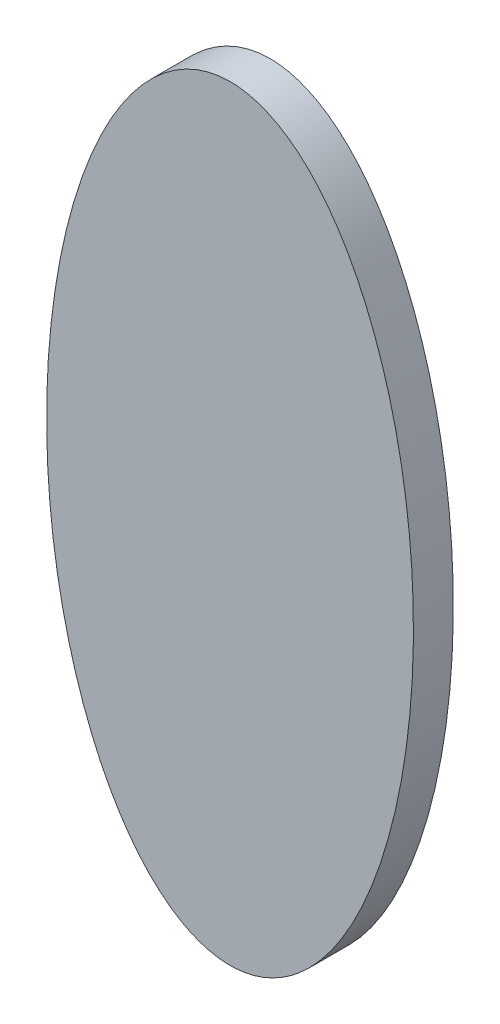
ISO-10303-21;
HEADER;
FILE_DESCRIPTION(('STEP AP214'),'2;1');
FILE_NAME('part.step','',(''),(''),'','','');
FILE_SCHEMA(('AUTOMOTIVE_DESIGN { 1 0 10303 214 1 1 1 1 }'));
ENDSEC;
DATA;
#1=APPLICATION_CONTEXT('core data for automotive mechanical design processes');
#2=APPLICATION_PROTOCOL_DEFINITION('international standard','automotive_design',2000,#1);
#3=PRODUCT_CONTEXT('',#1,'mechanical');
#4=PRODUCT('Part','Part','',(#3));
#5=PRODUCT_RELATED_PRODUCT_CATEGORY('part','',(#4));
#6=PRODUCT_DEFINITION_FORMATION('','',#4);
#7=PRODUCT_DEFINITION_CONTEXT('part definition',#1,'design');
#8=PRODUCT_DEFINITION('design','',#6,#7);
#9=PRODUCT_DEFINITION_SHAPE('','',#8);
#10=(LENGTH_UNIT() NAMED_UNIT(*) SI_UNIT(.MILLI.,.METRE.));
#11=(NAMED_UNIT(*) PLANE_ANGLE_UNIT() SI_UNIT($,.RADIAN.));
#12=(NAMED_UNIT(*) SI_UNIT($,.STERADIAN.) SOLID_ANGLE_UNIT());
#13=UNCERTAINTY_MEASURE_WITH_UNIT(LENGTH_MEASURE(1.E-05),#10,'distance_accuracy_value','');
#14=(GEOMETRIC_REPRESENTATION_CONTEXT(3) GLOBAL_UNCERTAINTY_ASSIGNED_CONTEXT((#13)) GLOBAL_UNIT_ASSIGNED_CONTEXT((#10,
#11,#12)) REPRESENTATION_CONTEXT('',''));
#15=CARTESIAN_POINT('',(0.,0.,0.));
#16=DIRECTION('',(0.,0.,1.));
#17=DIRECTION('',(1.,0.,0.));
#18=AXIS2_PLACEMENT_3D('',#15,#16,#17);
#19=CARTESIAN_POINT('',(0.,0.,10.));
#20=DIRECTION('',(0.,0.,1.));
#21=DIRECTION('',(0.,1.,0.));
#22=AXIS2_PLACEMENT_3D('',#19,#20,#21);
#23=ELLIPSE('',#22,96.,46.);
#24=DIRECTION('',(0.,0.,-1.));
#25=VECTOR('',#24,1.);
#26=SURFACE_OF_LINEAR_EXTRUSION('',#23,#25);
#27=CARTESIAN_POINT('',(0.,96.,10.));
#28=VERTEX_POINT('',#27);
#29=EDGE_CURVE('E10',#28,#28,#23,.T.);
#30=ORIENTED_EDGE('',*,*,#29,.F.);
#31=EDGE_LOOP('',(#30));
#32=FACE_BOUND('',#31,.T.);
#33=CARTESIAN_POINT('',(0.,0.,0.));
#34=DIRECTION('',(0.,0.,1.));
#35=DIRECTION('',(0.,1.,0.));
#36=AXIS2_PLACEMENT_3D('',#33,#34,#35);
#37=ELLIPSE('',#36,96.,46.);
#38=CARTESIAN_POINT('',(0.,96.,0.));
#39=VERTEX_POINT('',#38);
#40=EDGE_CURVE('E39',#39,#39,#37,.T.);
#41=ORIENTED_EDGE('',*,*,#40,.T.);
#42=EDGE_LOOP('',(#41));
#43=FACE_BOUND('',#42,.T.);
#44=ADVANCED_FACE('F35',(#32,#43),#26,.F.);
#45=CARTESIAN_POINT('',(0.,0.,10.));
#46=DIRECTION('',(0.,0.,1.));
#47=DIRECTION('',(1.,0.,0.));
#48=AXIS2_PLACEMENT_3D('',#45,#46,#47);
#49=PLANE('',#48);
#50=ORIENTED_EDGE('',*,*,#29,.T.);
#51=EDGE_LOOP('',(#50));
#52=FACE_BOUND('',#51,.T.);
#53=ADVANCED_FACE('F51',(#52),#49,.T.);
#54=CARTESIAN_POINT('',(0.,0.,0.));
#55=DIRECTION('',(0.,0.,1.));
#56=DIRECTION('',(1.,0.,0.));
#57=AXIS2_PLACEMENT_3D('',#54,#55,#56);
#58=PLANE('',#57);
#59=ORIENTED_EDGE('',*,*,#40,.F.);
#60=EDGE_LOOP('',(#59));
#61=FACE_BOUND('',#60,.T.);
#62=ADVANCED_FACE('F49',(#61),#58,.F.);
#63=CLOSED_SHELL('',(#44,#53,#62));
#64=MANIFOLD_SOLID_BREP('B2',#63);
#65=ADVANCED_BREP_SHAPE_REPRESENTATION('',(#18,#64),#14);
#66=SHAPE_DEFINITION_REPRESENTATION(#9,#65);
ENDSEC;
END-ISO-10303-21;
